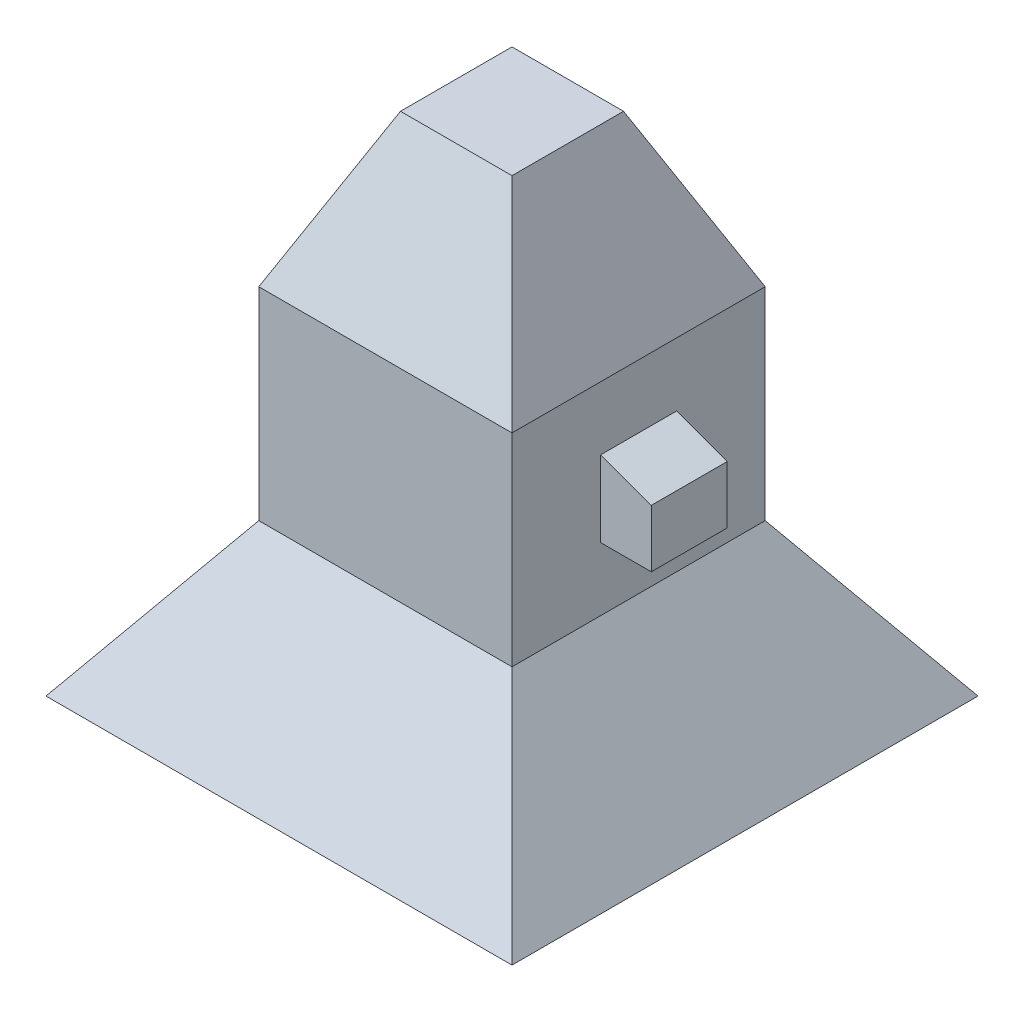
ISO-10303-21;
HEADER;
FILE_DESCRIPTION(('STEP AP214'),'2;1');
FILE_NAME('part.step','',(''),(''),'','','');
FILE_SCHEMA(('AUTOMOTIVE_DESIGN { 1 0 10303 214 1 1 1 1 }'));
ENDSEC;
DATA;
#1=APPLICATION_CONTEXT('core data for automotive mechanical design processes');
#2=APPLICATION_PROTOCOL_DEFINITION('international standard','automotive_design',2000,#1);
#3=PRODUCT_CONTEXT('',#1,'mechanical');
#4=PRODUCT('Part','Part','',(#3));
#5=PRODUCT_RELATED_PRODUCT_CATEGORY('part','',(#4));
#6=PRODUCT_DEFINITION_FORMATION('','',#4);
#7=PRODUCT_DEFINITION_CONTEXT('part definition',#1,'design');
#8=PRODUCT_DEFINITION('design','',#6,#7);
#9=PRODUCT_DEFINITION_SHAPE('','',#8);
#10=(LENGTH_UNIT() NAMED_UNIT(*) SI_UNIT(.MILLI.,.METRE.));
#11=(NAMED_UNIT(*) PLANE_ANGLE_UNIT() SI_UNIT($,.RADIAN.));
#12=(NAMED_UNIT(*) SI_UNIT($,.STERADIAN.) SOLID_ANGLE_UNIT());
#13=UNCERTAINTY_MEASURE_WITH_UNIT(LENGTH_MEASURE(1.E-05),#10,'distance_accuracy_value','');
#14=(GEOMETRIC_REPRESENTATION_CONTEXT(3) GLOBAL_UNCERTAINTY_ASSIGNED_CONTEXT((#13)) GLOBAL_UNIT_ASSIGNED_CONTEXT((#10,
#11,#12)) REPRESENTATION_CONTEXT('',''));
#15=CARTESIAN_POINT('',(0.,0.,0.));
#16=DIRECTION('',(0.,0.,1.));
#17=DIRECTION('',(1.,0.,0.));
#18=AXIS2_PLACEMENT_3D('',#15,#16,#17);
#19=CARTESIAN_POINT('',(50.,80.,50.));
#20=DIRECTION('',(-1.,0.,0.));
#21=DIRECTION('',(0.,0.,1.));
#22=AXIS2_PLACEMENT_3D('',#19,#20,#21);
#23=PLANE('',#22);
#24=DIRECTION('',(0.,0.,-1.));
#25=VECTOR('',#24,1.);
#26=CARTESIAN_POINT('',(50.,0.,50.));
#27=LINE('',#26,#25);
#28=CARTESIAN_POINT('',(50.,0.,50.));
#29=VERTEX_POINT('',#28);
#30=CARTESIAN_POINT('',(50.,0.,-50.));
#31=VERTEX_POINT('',#30);
#32=EDGE_CURVE('E224',#29,#31,#27,.T.);
#33=ORIENTED_EDGE('',*,*,#32,.T.);
#34=DIRECTION('',(0.,-1.,0.));
#35=VECTOR('',#34,1.);
#36=CARTESIAN_POINT('',(50.,80.,-50.));
#37=LINE('',#36,#35);
#38=CARTESIAN_POINT('',(50.,80.,-50.));
#39=VERTEX_POINT('',#38);
#40=EDGE_CURVE('E11',#39,#31,#37,.T.);
#41=ORIENTED_EDGE('',*,*,#40,.F.);
#42=DIRECTION('',(0.,0.,-1.));
#43=VECTOR('',#42,1.);
#44=CARTESIAN_POINT('',(50.,80.,50.));
#45=LINE('',#44,#43);
#46=CARTESIAN_POINT('',(50.,80.,50.));
#47=VERTEX_POINT('',#46);
#48=EDGE_CURVE('E242',#47,#39,#45,.T.);
#49=ORIENTED_EDGE('',*,*,#48,.F.);
#50=DIRECTION('',(0.,-1.,0.));
#51=VECTOR('',#50,1.);
#52=CARTESIAN_POINT('',(50.,80.,50.));
#53=LINE('',#52,#51);
#54=EDGE_CURVE('E255',#47,#29,#53,.T.);
#55=ORIENTED_EDGE('',*,*,#54,.T.);
#56=EDGE_LOOP('',(#33,#41,#49,#55));
#57=FACE_BOUND('',#56,.T.);
#58=DIRECTION('',(0.,1.,0.));
#59=VECTOR('',#58,1.);
#60=CARTESIAN_POINT('',(50.,25.,-15.));
#61=LINE('',#60,#59);
#62=CARTESIAN_POINT('',(50.,25.,-15.));
#63=VERTEX_POINT('',#62);
#64=CARTESIAN_POINT('',(50.,55.,-15.));
#65=VERTEX_POINT('',#64);
#66=EDGE_CURVE('E69',#63,#65,#61,.T.);
#67=ORIENTED_EDGE('',*,*,#66,.F.);
#68=DIRECTION('',(0.,0.,-1.));
#69=VECTOR('',#68,1.);
#70=CARTESIAN_POINT('',(50.,25.,15.));
#71=LINE('',#70,#69);
#72=CARTESIAN_POINT('',(50.,25.,15.));
#73=VERTEX_POINT('',#72);
#74=EDGE_CURVE('E146',#73,#63,#71,.T.);
#75=ORIENTED_EDGE('',*,*,#74,.F.);
#76=DIRECTION('',(0.,-1.,0.));
#77=VECTOR('',#76,1.);
#78=CARTESIAN_POINT('',(50.,25.,15.));
#79=LINE('',#78,#77);
#80=CARTESIAN_POINT('',(50.,55.,15.));
#81=VERTEX_POINT('',#80);
#82=EDGE_CURVE('E148',#81,#73,#79,.T.);
#83=ORIENTED_EDGE('',*,*,#82,.F.);
#84=DIRECTION('',(0.,0.,1.));
#85=VECTOR('',#84,1.);
#86=CARTESIAN_POINT('',(50.,55.,15.));
#87=LINE('',#86,#85);
#88=EDGE_CURVE('E52',#65,#81,#87,.T.);
#89=ORIENTED_EDGE('',*,*,#88,.F.);
#90=EDGE_LOOP('',(#67,#75,#83,#89));
#91=FACE_BOUND('',#90,.T.);
#92=ADVANCED_FACE('F33',(#57,#91),#23,.F.);
#93=CARTESIAN_POINT('',(0.,-60.,0.));
#94=DIRECTION('',(0.,-1.,0.));
#95=DIRECTION('',(0.,0.,-1.));
#96=AXIS2_PLACEMENT_3D('',#93,#94,#95);
#97=PLANE('',#96);
#98=DIRECTION('',(-1.,0.,0.));
#99=VECTOR('',#98,1.);
#100=CARTESIAN_POINT('',(-50.,-60.,-92.0124522925827));
#101=LINE('',#100,#99);
#102=CARTESIAN_POINT('',(-92.0124522925827,-60.,-92.0124522925827));
#103=VERTEX_POINT('',#102);
#104=CARTESIAN_POINT('',(92.0124522925827,-60.,-92.0124522925827));
#105=VERTEX_POINT('',#104);
#106=EDGE_CURVE('E184',#103,#105,#101,.F.);
#107=ORIENTED_EDGE('',*,*,#106,.T.);
#108=DIRECTION('',(0.,0.,-1.));
#109=VECTOR('',#108,1.);
#110=CARTESIAN_POINT('',(92.0124522925827,-60.,-50.));
#111=LINE('',#110,#109);
#112=CARTESIAN_POINT('',(92.0124522925827,-60.,92.0124522925827));
#113=VERTEX_POINT('',#112);
#114=EDGE_CURVE('E216',#105,#113,#111,.F.);
#115=ORIENTED_EDGE('',*,*,#114,.T.);
#116=DIRECTION('',(1.,0.,0.));
#117=VECTOR('',#116,1.);
#118=CARTESIAN_POINT('',(50.,-60.,92.0124522925827));
#119=LINE('',#118,#117);
#120=CARTESIAN_POINT('',(-92.0124522925827,-60.,92.0124522925827));
#121=VERTEX_POINT('',#120);
#122=EDGE_CURVE('E218',#113,#121,#119,.F.);
#123=ORIENTED_EDGE('',*,*,#122,.T.);
#124=DIRECTION('',(0.,0.,1.));
#125=VECTOR('',#124,1.);
#126=CARTESIAN_POINT('',(-92.0124522925827,-60.,50.));
#127=LINE('',#126,#125);
#128=EDGE_CURVE('E209',#121,#103,#127,.F.);
#129=ORIENTED_EDGE('',*,*,#128,.T.);
#130=EDGE_LOOP('',(#107,#115,#123,#129));
#131=FACE_BOUND('',#130,.T.);
#132=DIRECTION('',(-1.,0.,0.));
#133=VECTOR('',#132,1.);
#134=CARTESIAN_POINT('',(0.,-60.,-86.016603056777));
#135=LINE('',#134,#133);
#136=CARTESIAN_POINT('',(-86.016603056777,-60.,-86.016603056777));
#137=VERTEX_POINT('',#136);
#138=CARTESIAN_POINT('',(86.0166030567769,-60.,-86.016603056777));
#139=VERTEX_POINT('',#138);
#140=EDGE_CURVE('E196',#137,#139,#135,.F.);
#141=ORIENTED_EDGE('',*,*,#140,.F.);
#142=DIRECTION('',(0.,0.,1.));
#143=VECTOR('',#142,1.);
#144=CARTESIAN_POINT('',(-86.016603056777,-60.,0.));
#145=LINE('',#144,#143);
#146=CARTESIAN_POINT('',(-86.016603056777,-60.,86.016603056777));
#147=VERTEX_POINT('',#146);
#148=EDGE_CURVE('E180',#147,#137,#145,.F.);
#149=ORIENTED_EDGE('',*,*,#148,.F.);
#150=DIRECTION('',(1.,0.,0.));
#151=VECTOR('',#150,1.);
#152=CARTESIAN_POINT('',(0.,-60.,86.016603056777));
#153=LINE('',#152,#151);
#154=CARTESIAN_POINT('',(86.0166030567769,-60.,86.016603056777));
#155=VERTEX_POINT('',#154);
#156=EDGE_CURVE('E190',#155,#147,#153,.F.);
#157=ORIENTED_EDGE('',*,*,#156,.F.);
#158=DIRECTION('',(0.,0.,-1.));
#159=VECTOR('',#158,1.);
#160=CARTESIAN_POINT('',(86.0166030567769,-60.,0.));
#161=LINE('',#160,#159);
#162=EDGE_CURVE('E198',#139,#155,#161,.F.);
#163=ORIENTED_EDGE('',*,*,#162,.F.);
#164=EDGE_LOOP('',(#141,#149,#157,#163));
#165=FACE_BOUND('',#164,.T.);
#166=ADVANCED_FACE('F293',(#131,#165),#97,.T.);
#167=CARTESIAN_POINT('',(-50.,80.,-50.));
#168=DIRECTION('',(0.,0.,1.));
#169=DIRECTION('',(1.,0.,0.));
#170=AXIS2_PLACEMENT_3D('',#167,#168,#169);
#171=PLANE('',#170);
#172=DIRECTION('',(-1.,0.,0.));
#173=VECTOR('',#172,1.);
#174=CARTESIAN_POINT('',(-50.,0.,-50.));
#175=LINE('',#174,#173);
#176=CARTESIAN_POINT('',(-50.,0.,-50.));
#177=VERTEX_POINT('',#176);
#178=EDGE_CURVE('E258',#31,#177,#175,.T.);
#179=ORIENTED_EDGE('',*,*,#178,.T.);
#180=DIRECTION('',(0.,-1.,0.));
#181=VECTOR('',#180,1.);
#182=CARTESIAN_POINT('',(-50.,80.,-50.));
#183=LINE('',#182,#181);
#184=CARTESIAN_POINT('',(-50.,80.,-50.));
#185=VERTEX_POINT('',#184);
#186=EDGE_CURVE('E43',#185,#177,#183,.T.);
#187=ORIENTED_EDGE('',*,*,#186,.F.);
#188=DIRECTION('',(-1.,0.,0.));
#189=VECTOR('',#188,1.);
#190=CARTESIAN_POINT('',(-50.,80.,-50.));
#191=LINE('',#190,#189);
#192=EDGE_CURVE('E245',#39,#185,#191,.T.);
#193=ORIENTED_EDGE('',*,*,#192,.F.);
#194=ORIENTED_EDGE('',*,*,#40,.T.);
#195=EDGE_LOOP('',(#179,#187,#193,#194));
#196=FACE_BOUND('',#195,.T.);
#197=ADVANCED_FACE('F298',(#196),#171,.F.);
#198=CARTESIAN_POINT('',(-50.,80.,50.));
#199=DIRECTION('',(1.,0.,0.));
#200=DIRECTION('',(0.,0.,-1.));
#201=AXIS2_PLACEMENT_3D('',#198,#199,#200);
#202=PLANE('',#201);
#203=DIRECTION('',(0.,0.,1.));
#204=VECTOR('',#203,1.);
#205=CARTESIAN_POINT('',(-50.,0.,50.));
#206=LINE('',#205,#204);
#207=CARTESIAN_POINT('',(-50.,0.,50.));
#208=VERTEX_POINT('',#207);
#209=EDGE_CURVE('E261',#177,#208,#206,.T.);
#210=ORIENTED_EDGE('',*,*,#209,.T.);
#211=DIRECTION('',(0.,-1.,0.));
#212=VECTOR('',#211,1.);
#213=CARTESIAN_POINT('',(-50.,80.,50.));
#214=LINE('',#213,#212);
#215=CARTESIAN_POINT('',(-50.,80.,50.));
#216=VERTEX_POINT('',#215);
#217=EDGE_CURVE('E268',#216,#208,#214,.T.);
#218=ORIENTED_EDGE('',*,*,#217,.F.);
#219=DIRECTION('',(0.,0.,1.));
#220=VECTOR('',#219,1.);
#221=CARTESIAN_POINT('',(-50.,80.,50.));
#222=LINE('',#221,#220);
#223=EDGE_CURVE('E249',#185,#216,#222,.T.);
#224=ORIENTED_EDGE('',*,*,#223,.F.);
#225=ORIENTED_EDGE('',*,*,#186,.T.);
#226=EDGE_LOOP('',(#210,#218,#224,#225));
#227=FACE_BOUND('',#226,.T.);
#228=ADVANCED_FACE('F304',(#227),#202,.F.);
#229=CARTESIAN_POINT('',(-50.,80.,50.));
#230=DIRECTION('',(0.,0.,-1.));
#231=DIRECTION('',(-1.,0.,0.));
#232=AXIS2_PLACEMENT_3D('',#229,#230,#231);
#233=PLANE('',#232);
#234=DIRECTION('',(1.,0.,0.));
#235=VECTOR('',#234,1.);
#236=CARTESIAN_POINT('',(-50.,0.,50.));
#237=LINE('',#236,#235);
#238=EDGE_CURVE('E246',#208,#29,#237,.T.);
#239=ORIENTED_EDGE('',*,*,#238,.T.);
#240=ORIENTED_EDGE('',*,*,#54,.F.);
#241=DIRECTION('',(1.,0.,0.));
#242=VECTOR('',#241,1.);
#243=CARTESIAN_POINT('',(-50.,80.,50.));
#244=LINE('',#243,#242);
#245=EDGE_CURVE('E252',#216,#47,#244,.T.);
#246=ORIENTED_EDGE('',*,*,#245,.F.);
#247=ORIENTED_EDGE('',*,*,#217,.T.);
#248=EDGE_LOOP('',(#239,#240,#246,#247));
#249=FACE_BOUND('',#248,.T.);
#250=ADVANCED_FACE('F308',(#249),#233,.F.);
#251=CARTESIAN_POINT('',(-50.,80.,50.));
#252=DIRECTION('',(0.,0.4226182617407,0.90630778703665));
#253=DIRECTION('',(0.,-0.90630778703665,0.4226182617407));
#254=AXIS2_PLACEMENT_3D('',#251,#252,#253);
#255=PLANE('',#254);
#256=ORIENTED_EDGE('',*,*,#245,.T.);
#257=DIRECTION('',(0.389281620635026,-0.834817129478987,0.389281620635026));
#258=VECTOR('',#257,1.);
#259=CARTESIAN_POINT('',(50.,80.,50.));
#260=LINE('',#259,#258);
#261=CARTESIAN_POINT('',(22.0215405107,140.,22.0215405107));
#262=VERTEX_POINT('',#261);
#263=EDGE_CURVE('E221',#262,#47,#260,.T.);
#264=ORIENTED_EDGE('',*,*,#263,.F.);
#265=DIRECTION('',(-1.,0.,0.));
#266=VECTOR('',#265,1.);
#267=CARTESIAN_POINT('',(-50.,140.,22.0215405107));
#268=LINE('',#267,#266);
#269=CARTESIAN_POINT('',(-22.0215405107,140.,22.0215405107));
#270=VERTEX_POINT('',#269);
#271=EDGE_CURVE('E204',#270,#262,#268,.F.);
#272=ORIENTED_EDGE('',*,*,#271,.F.);
#273=DIRECTION('',(-0.389281620635026,-0.834817129478987,0.389281620635026));
#274=VECTOR('',#273,1.);
#275=CARTESIAN_POINT('',(-50.,80.,50.));
#276=LINE('',#275,#274);
#277=EDGE_CURVE('E226',#270,#216,#276,.T.);
#278=ORIENTED_EDGE('',*,*,#277,.T.);
#279=EDGE_LOOP('',(#256,#264,#272,#278));
#280=FACE_BOUND('',#279,.T.);
#281=ADVANCED_FACE('F312',(#280),#255,.T.);
#282=CARTESIAN_POINT('',(50.,80.,50.));
#283=DIRECTION('',(0.90630778703665,0.4226182617407,0.));
#284=DIRECTION('',(-0.4226182617407,0.90630778703665,0.));
#285=AXIS2_PLACEMENT_3D('',#282,#283,#284);
#286=PLANE('',#285);
#287=ORIENTED_EDGE('',*,*,#48,.T.);
#288=DIRECTION('',(0.389281620635026,-0.834817129478987,-0.389281620635026));
#289=VECTOR('',#288,1.);
#290=CARTESIAN_POINT('',(50.,80.,-50.));
#291=LINE('',#290,#289);
#292=CARTESIAN_POINT('',(22.0215405107,140.,-22.0215405107));
#293=VERTEX_POINT('',#292);
#294=EDGE_CURVE('E225',#293,#39,#291,.T.);
#295=ORIENTED_EDGE('',*,*,#294,.F.);
#296=DIRECTION('',(0.,0.,1.));
#297=VECTOR('',#296,1.);
#298=CARTESIAN_POINT('',(22.0215405107,140.,50.));
#299=LINE('',#298,#297);
#300=EDGE_CURVE('E237',#262,#293,#299,.F.);
#301=ORIENTED_EDGE('',*,*,#300,.F.);
#302=ORIENTED_EDGE('',*,*,#263,.T.);
#303=EDGE_LOOP('',(#287,#295,#301,#302));
#304=FACE_BOUND('',#303,.T.);
#305=ADVANCED_FACE('F314',(#304),#286,.T.);
#306=CARTESIAN_POINT('',(50.,80.,-50.));
#307=DIRECTION('',(0.,0.4226182617407,-0.90630778703665));
#308=DIRECTION('',(0.,0.90630778703665,0.4226182617407));
#309=AXIS2_PLACEMENT_3D('',#306,#307,#308);
#310=PLANE('',#309);
#311=ORIENTED_EDGE('',*,*,#192,.T.);
#312=DIRECTION('',(-0.389281620635026,-0.834817129478987,-0.389281620635026));
#313=VECTOR('',#312,1.);
#314=CARTESIAN_POINT('',(-50.,80.,-50.));
#315=LINE('',#314,#313);
#316=CARTESIAN_POINT('',(-22.0215405107,140.,-22.0215405107));
#317=VERTEX_POINT('',#316);
#318=EDGE_CURVE('E229',#317,#185,#315,.T.);
#319=ORIENTED_EDGE('',*,*,#318,.F.);
#320=DIRECTION('',(1.,0.,0.));
#321=VECTOR('',#320,1.);
#322=CARTESIAN_POINT('',(50.,140.,-22.0215405107));
#323=LINE('',#322,#321);
#324=EDGE_CURVE('E239',#293,#317,#323,.F.);
#325=ORIENTED_EDGE('',*,*,#324,.F.);
#326=ORIENTED_EDGE('',*,*,#294,.T.);
#327=EDGE_LOOP('',(#311,#319,#325,#326));
#328=FACE_BOUND('',#327,.T.);
#329=ADVANCED_FACE('F317',(#328),#310,.T.);
#330=CARTESIAN_POINT('',(-50.,80.,-50.));
#331=DIRECTION('',(-0.90630778703665,0.4226182617407,0.));
#332=DIRECTION('',(-0.4226182617407,-0.90630778703665,0.));
#333=AXIS2_PLACEMENT_3D('',#330,#331,#332);
#334=PLANE('',#333);
#335=ORIENTED_EDGE('',*,*,#223,.T.);
#336=ORIENTED_EDGE('',*,*,#277,.F.);
#337=DIRECTION('',(0.,0.,-1.));
#338=VECTOR('',#337,1.);
#339=CARTESIAN_POINT('',(-22.0215405107,140.,-50.));
#340=LINE('',#339,#338);
#341=EDGE_CURVE('E230',#317,#270,#340,.F.);
#342=ORIENTED_EDGE('',*,*,#341,.F.);
#343=ORIENTED_EDGE('',*,*,#318,.T.);
#344=EDGE_LOOP('',(#335,#336,#342,#343));
#345=FACE_BOUND('',#344,.T.);
#346=ADVANCED_FACE('F321',(#345),#334,.T.);
#347=CARTESIAN_POINT('',(0.,140.,0.));
#348=DIRECTION('',(0.,1.,0.));
#349=DIRECTION('',(0.,0.,1.));
#350=AXIS2_PLACEMENT_3D('',#347,#348,#349);
#351=PLANE('',#350);
#352=ORIENTED_EDGE('',*,*,#271,.T.);
#353=ORIENTED_EDGE('',*,*,#300,.T.);
#354=ORIENTED_EDGE('',*,*,#324,.T.);
#355=ORIENTED_EDGE('',*,*,#341,.T.);
#356=EDGE_LOOP('',(#352,#353,#354,#355));
#357=FACE_BOUND('',#356,.T.);
#358=ADVANCED_FACE('F325',(#357),#351,.T.);
#359=CARTESIAN_POINT('',(-50.,0.,-50.));
#360=DIRECTION('',(0.,0.573576436351047,-0.819152044288991));
#361=DIRECTION('',(0.,0.819152044288991,0.573576436351047));
#362=AXIS2_PLACEMENT_3D('',#359,#360,#361);
#363=PLANE('',#362);
#364=ORIENTED_EDGE('',*,*,#178,.F.);
#365=DIRECTION('',(-0.497542812164524,0.710564775461629,0.497542812164524));
#366=VECTOR('',#365,1.);
#367=CARTESIAN_POINT('',(50.,0.,-50.));
#368=LINE('',#367,#366);
#369=EDGE_CURVE('E202',#105,#31,#368,.T.);
#370=ORIENTED_EDGE('',*,*,#369,.F.);
#371=ORIENTED_EDGE('',*,*,#106,.F.);
#372=DIRECTION('',(0.497542812164524,0.710564775461629,0.497542812164524));
#373=VECTOR('',#372,1.);
#374=CARTESIAN_POINT('',(-50.,0.,-50.));
#375=LINE('',#374,#373);
#376=EDGE_CURVE('E206',#103,#177,#375,.T.);
#377=ORIENTED_EDGE('',*,*,#376,.T.);
#378=EDGE_LOOP('',(#364,#370,#371,#377));
#379=FACE_BOUND('',#378,.T.);
#380=ADVANCED_FACE('F332',(#379),#363,.T.);
#381=CARTESIAN_POINT('',(50.,0.,-50.));
#382=DIRECTION('',(0.819152044288991,0.573576436351047,0.));
#383=DIRECTION('',(-0.573576436351047,0.819152044288991,0.));
#384=AXIS2_PLACEMENT_3D('',#381,#382,#383);
#385=PLANE('',#384);
#386=ORIENTED_EDGE('',*,*,#32,.F.);
#387=DIRECTION('',(-0.497542812164524,0.710564775461629,-0.497542812164524));
#388=VECTOR('',#387,1.);
#389=CARTESIAN_POINT('',(50.,0.,50.));
#390=LINE('',#389,#388);
#391=EDGE_CURVE('E205',#113,#29,#390,.T.);
#392=ORIENTED_EDGE('',*,*,#391,.F.);
#393=ORIENTED_EDGE('',*,*,#114,.F.);
#394=ORIENTED_EDGE('',*,*,#369,.T.);
#395=EDGE_LOOP('',(#386,#392,#393,#394));
#396=FACE_BOUND('',#395,.T.);
#397=ADVANCED_FACE('F334',(#396),#385,.T.);
#398=CARTESIAN_POINT('',(50.,0.,50.));
#399=DIRECTION('',(0.,0.573576436351047,0.819152044288991));
#400=DIRECTION('',(0.,-0.819152044288991,0.573576436351047));
#401=AXIS2_PLACEMENT_3D('',#398,#399,#400);
#402=PLANE('',#401);
#403=ORIENTED_EDGE('',*,*,#238,.F.);
#404=DIRECTION('',(0.497542812164524,0.710564775461629,-0.497542812164524));
#405=VECTOR('',#404,1.);
#406=CARTESIAN_POINT('',(-50.,0.,50.));
#407=LINE('',#406,#405);
#408=EDGE_CURVE('E208',#121,#208,#407,.T.);
#409=ORIENTED_EDGE('',*,*,#408,.F.);
#410=ORIENTED_EDGE('',*,*,#122,.F.);
#411=ORIENTED_EDGE('',*,*,#391,.T.);
#412=EDGE_LOOP('',(#403,#409,#410,#411));
#413=FACE_BOUND('',#412,.T.);
#414=ADVANCED_FACE('F337',(#413),#402,.T.);
#415=CARTESIAN_POINT('',(-50.,0.,50.));
#416=DIRECTION('',(-0.819152044288991,0.573576436351047,0.));
#417=DIRECTION('',(-0.573576436351047,-0.819152044288991,0.));
#418=AXIS2_PLACEMENT_3D('',#415,#416,#417);
#419=PLANE('',#418);
#420=ORIENTED_EDGE('',*,*,#209,.F.);
#421=ORIENTED_EDGE('',*,*,#376,.F.);
#422=ORIENTED_EDGE('',*,*,#128,.F.);
#423=ORIENTED_EDGE('',*,*,#408,.T.);
#424=EDGE_LOOP('',(#420,#421,#422,#423));
#425=FACE_BOUND('',#424,.T.);
#426=ADVANCED_FACE('F341',(#425),#419,.T.);
#427=CARTESIAN_POINT('',(-72.0124522925827,-40.,72.0124522925827));
#428=DIRECTION('',(-0.819152044288991,0.573576436351047,0.));
#429=DIRECTION('',(-0.573576436351047,-0.819152044288991,0.));
#430=AXIS2_PLACEMENT_3D('',#427,#428,#429);
#431=PLANE('',#430);
#432=DIRECTION('',(0.,0.,-1.));
#433=VECTOR('',#432,1.);
#434=CARTESIAN_POINT('',(-72.0124522925827,-40.,72.0124522925827));
#435=LINE('',#434,#433);
#436=CARTESIAN_POINT('',(-72.0124522925827,-40.,72.0124522925827));
#437=VERTEX_POINT('',#436);
#438=CARTESIAN_POINT('',(-72.0124522925827,-40.,-72.0124522925827));
#439=VERTEX_POINT('',#438);
#440=EDGE_CURVE('E171',#437,#439,#435,.T.);
#441=ORIENTED_EDGE('',*,*,#440,.F.);
#442=DIRECTION('',(0.497542812164524,0.710564775461629,-0.497542812164524));
#443=VECTOR('',#442,1.);
#444=CARTESIAN_POINT('',(-72.0124522925827,-40.,72.0124522925827));
#445=LINE('',#444,#443);
#446=EDGE_CURVE('E186',#147,#437,#445,.T.);
#447=ORIENTED_EDGE('',*,*,#446,.F.);
#448=ORIENTED_EDGE('',*,*,#148,.T.);
#449=DIRECTION('',(0.497542812164524,0.710564775461629,0.497542812164524));
#450=VECTOR('',#449,1.);
#451=CARTESIAN_POINT('',(-36.359252800299,10.9180457888838,-36.359252800299));
#452=LINE('',#451,#450);
#453=EDGE_CURVE('E181',#137,#439,#452,.T.);
#454=ORIENTED_EDGE('',*,*,#453,.T.);
#455=EDGE_LOOP('',(#441,#447,#448,#454));
#456=FACE_BOUND('',#455,.T.);
#457=ADVANCED_FACE('F345',(#456),#431,.F.);
#458=CARTESIAN_POINT('',(72.0124522925827,-40.,-72.0124522925827));
#459=DIRECTION('',(0.,0.573576436351047,-0.819152044288991));
#460=DIRECTION('',(0.,0.819152044288991,0.573576436351047));
#461=AXIS2_PLACEMENT_3D('',#458,#459,#460);
#462=PLANE('',#461);
#463=DIRECTION('',(1.,0.,0.));
#464=VECTOR('',#463,1.);
#465=CARTESIAN_POINT('',(72.0124522925827,-40.,-72.0124522925827));
#466=LINE('',#465,#464);
#467=CARTESIAN_POINT('',(72.0124522925827,-40.,-72.0124522925827));
#468=VERTEX_POINT('',#467);
#469=EDGE_CURVE('E174',#439,#468,#466,.T.);
#470=ORIENTED_EDGE('',*,*,#469,.F.);
#471=ORIENTED_EDGE('',*,*,#453,.F.);
#472=ORIENTED_EDGE('',*,*,#140,.T.);
#473=DIRECTION('',(-0.497542812164524,0.710564775461629,0.497542812164524));
#474=VECTOR('',#473,1.);
#475=CARTESIAN_POINT('',(36.3592528002989,10.9180457888838,-36.359252800299));
#476=LINE('',#475,#474);
#477=EDGE_CURVE('E185',#139,#468,#476,.T.);
#478=ORIENTED_EDGE('',*,*,#477,.T.);
#479=EDGE_LOOP('',(#470,#471,#472,#478));
#480=FACE_BOUND('',#479,.T.);
#481=ADVANCED_FACE('F350',(#480),#462,.F.);
#482=CARTESIAN_POINT('',(72.0124522925827,-40.,72.0124522925827));
#483=DIRECTION('',(0.819152044288991,0.573576436351047,0.));
#484=DIRECTION('',(-0.573576436351047,0.819152044288991,0.));
#485=AXIS2_PLACEMENT_3D('',#482,#483,#484);
#486=PLANE('',#485);
#487=DIRECTION('',(0.,0.,1.));
#488=VECTOR('',#487,1.);
#489=CARTESIAN_POINT('',(72.0124522925827,-40.,72.0124522925827));
#490=LINE('',#489,#488);
#491=CARTESIAN_POINT('',(72.0124522925827,-40.,72.0124522925827));
#492=VERTEX_POINT('',#491);
#493=EDGE_CURVE('E176',#468,#492,#490,.T.);
#494=ORIENTED_EDGE('',*,*,#493,.F.);
#495=ORIENTED_EDGE('',*,*,#477,.F.);
#496=ORIENTED_EDGE('',*,*,#162,.T.);
#497=DIRECTION('',(-0.497542812164524,0.710564775461629,-0.497542812164524));
#498=VECTOR('',#497,1.);
#499=CARTESIAN_POINT('',(72.0124522925827,-40.,72.0124522925827));
#500=LINE('',#499,#498);
#501=EDGE_CURVE('E189',#155,#492,#500,.T.);
#502=ORIENTED_EDGE('',*,*,#501,.T.);
#503=EDGE_LOOP('',(#494,#495,#496,#502));
#504=FACE_BOUND('',#503,.T.);
#505=ADVANCED_FACE('F353',(#504),#486,.F.);
#506=CARTESIAN_POINT('',(72.0124522925827,-40.,72.0124522925827));
#507=DIRECTION('',(0.,0.573576436351047,0.819152044288991));
#508=DIRECTION('',(0.,-0.819152044288991,0.573576436351047));
#509=AXIS2_PLACEMENT_3D('',#506,#507,#508);
#510=PLANE('',#509);
#511=DIRECTION('',(-1.,0.,0.));
#512=VECTOR('',#511,1.);
#513=CARTESIAN_POINT('',(72.0124522925827,-40.,72.0124522925827));
#514=LINE('',#513,#512);
#515=EDGE_CURVE('E178',#492,#437,#514,.T.);
#516=ORIENTED_EDGE('',*,*,#515,.F.);
#517=ORIENTED_EDGE('',*,*,#501,.F.);
#518=ORIENTED_EDGE('',*,*,#156,.T.);
#519=ORIENTED_EDGE('',*,*,#446,.T.);
#520=EDGE_LOOP('',(#516,#517,#518,#519));
#521=FACE_BOUND('',#520,.T.);
#522=ADVANCED_FACE('F357',(#521),#510,.F.);
#523=CARTESIAN_POINT('',(0.,-40.,0.));
#524=DIRECTION('',(0.,1.,0.));
#525=DIRECTION('',(0.,0.,1.));
#526=AXIS2_PLACEMENT_3D('',#523,#524,#525);
#527=PLANE('',#526);
#528=ORIENTED_EDGE('',*,*,#440,.T.);
#529=ORIENTED_EDGE('',*,*,#469,.T.);
#530=ORIENTED_EDGE('',*,*,#493,.T.);
#531=ORIENTED_EDGE('',*,*,#515,.T.);
#532=EDGE_LOOP('',(#528,#529,#530,#531));
#533=FACE_BOUND('',#532,.T.);
#534=ADVANCED_FACE('F361',(#533),#527,.F.);
#535=CARTESIAN_POINT('',(70.,25.,-15.));
#536=DIRECTION('',(0.,0.,1.));
#537=DIRECTION('',(1.,0.,0.));
#538=AXIS2_PLACEMENT_3D('',#535,#536,#537);
#539=PLANE('',#538);
#540=ORIENTED_EDGE('',*,*,#66,.T.);
#541=DIRECTION('',(0.939692620785908,-0.342020143325669,0.));
#542=VECTOR('',#541,1.);
#543=CARTESIAN_POINT('',(50.,55.,-15.));
#544=LINE('',#543,#542);
#545=CARTESIAN_POINT('',(70.,47.7205953146759,-15.));
#546=VERTEX_POINT('',#545);
#547=EDGE_CURVE('E168',#546,#65,#544,.F.);
#548=ORIENTED_EDGE('',*,*,#547,.F.);
#549=DIRECTION('',(0.,1.,0.));
#550=VECTOR('',#549,1.);
#551=CARTESIAN_POINT('',(70.,25.,-15.));
#552=LINE('',#551,#550);
#553=CARTESIAN_POINT('',(70.,25.,-15.));
#554=VERTEX_POINT('',#553);
#555=EDGE_CURVE('E153',#554,#546,#552,.T.);
#556=ORIENTED_EDGE('',*,*,#555,.F.);
#557=DIRECTION('',(-1.,0.,0.));
#558=VECTOR('',#557,1.);
#559=CARTESIAN_POINT('',(70.,25.,-15.));
#560=LINE('',#559,#558);
#561=EDGE_CURVE('E166',#554,#63,#560,.T.);
#562=ORIENTED_EDGE('',*,*,#561,.T.);
#563=EDGE_LOOP('',(#540,#548,#556,#562));
#564=FACE_BOUND('',#563,.T.);
#565=ADVANCED_FACE('F284',(#564),#539,.F.);
#566=CARTESIAN_POINT('',(50.,55.,15.));
#567=DIRECTION('',(0.342020143325669,0.939692620785908,0.));
#568=DIRECTION('',(-0.939692620785908,0.342020143325669,0.));
#569=AXIS2_PLACEMENT_3D('',#566,#567,#568);
#570=PLANE('',#569);
#571=ORIENTED_EDGE('',*,*,#88,.T.);
#572=DIRECTION('',(0.939692620785908,-0.342020143325669,0.));
#573=VECTOR('',#572,1.);
#574=CARTESIAN_POINT('',(77.3022585764879,45.0627905499193,15.));
#575=LINE('',#574,#573);
#576=CARTESIAN_POINT('',(70.,47.7205953146759,15.));
#577=VERTEX_POINT('',#576);
#578=EDGE_CURVE('E37',#577,#81,#575,.F.);
#579=ORIENTED_EDGE('',*,*,#578,.F.);
#580=DIRECTION('',(0.,0.,-1.));
#581=VECTOR('',#580,1.);
#582=CARTESIAN_POINT('',(70.,47.7205953146759,0.));
#583=LINE('',#582,#581);
#584=EDGE_CURVE('E63',#546,#577,#583,.F.);
#585=ORIENTED_EDGE('',*,*,#584,.F.);
#586=ORIENTED_EDGE('',*,*,#547,.T.);
#587=EDGE_LOOP('',(#571,#579,#585,#586));
#588=FACE_BOUND('',#587,.T.);
#589=ADVANCED_FACE('F35',(#588),#570,.T.);
#590=CARTESIAN_POINT('',(70.,25.,15.));
#591=DIRECTION('',(0.,0.,-1.));
#592=DIRECTION('',(-1.,0.,0.));
#593=AXIS2_PLACEMENT_3D('',#590,#591,#592);
#594=PLANE('',#593);
#595=ORIENTED_EDGE('',*,*,#82,.T.);
#596=DIRECTION('',(-1.,0.,0.));
#597=VECTOR('',#596,1.);
#598=CARTESIAN_POINT('',(70.,25.,15.));
#599=LINE('',#598,#597);
#600=CARTESIAN_POINT('',(70.,25.,15.));
#601=VERTEX_POINT('',#600);
#602=EDGE_CURVE('E160',#601,#73,#599,.T.);
#603=ORIENTED_EDGE('',*,*,#602,.F.);
#604=DIRECTION('',(0.,-1.,0.));
#605=VECTOR('',#604,1.);
#606=CARTESIAN_POINT('',(70.,25.,15.));
#607=LINE('',#606,#605);
#608=EDGE_CURVE('E273',#577,#601,#607,.T.);
#609=ORIENTED_EDGE('',*,*,#608,.F.);
#610=ORIENTED_EDGE('',*,*,#578,.T.);
#611=EDGE_LOOP('',(#595,#603,#609,#610));
#612=FACE_BOUND('',#611,.T.);
#613=ADVANCED_FACE('F158',(#612),#594,.F.);
#614=CARTESIAN_POINT('',(70.,25.,15.));
#615=DIRECTION('',(0.,1.,0.));
#616=DIRECTION('',(0.,0.,1.));
#617=AXIS2_PLACEMENT_3D('',#614,#615,#616);
#618=PLANE('',#617);
#619=ORIENTED_EDGE('',*,*,#74,.T.);
#620=ORIENTED_EDGE('',*,*,#561,.F.);
#621=DIRECTION('',(0.,0.,-1.));
#622=VECTOR('',#621,1.);
#623=CARTESIAN_POINT('',(70.,25.,15.));
#624=LINE('',#623,#622);
#625=EDGE_CURVE('E165',#601,#554,#624,.T.);
#626=ORIENTED_EDGE('',*,*,#625,.F.);
#627=ORIENTED_EDGE('',*,*,#602,.T.);
#628=EDGE_LOOP('',(#619,#620,#626,#627));
#629=FACE_BOUND('',#628,.T.);
#630=ADVANCED_FACE('F163',(#629),#618,.F.);
#631=CARTESIAN_POINT('',(70.,0.,0.));
#632=DIRECTION('',(-1.,0.,0.));
#633=DIRECTION('',(0.,0.,1.));
#634=AXIS2_PLACEMENT_3D('',#631,#632,#633);
#635=PLANE('',#634);
#636=ORIENTED_EDGE('',*,*,#555,.T.);
#637=ORIENTED_EDGE('',*,*,#584,.T.);
#638=ORIENTED_EDGE('',*,*,#608,.T.);
#639=ORIENTED_EDGE('',*,*,#625,.T.);
#640=EDGE_LOOP('',(#636,#637,#638,#639));
#641=FACE_BOUND('',#640,.T.);
#642=ADVANCED_FACE('F285',(#641),#635,.F.);
#643=CLOSED_SHELL('',(#92,#166,#197,#228,#250,#281,#305,#329,#346,#358,#380,#397,#414,#426,#457,
#481,#505,#522,#534,#565,#589,#613,#630,#642));
#644=MANIFOLD_SOLID_BREP('B2',#643);
#645=ADVANCED_BREP_SHAPE_REPRESENTATION('',(#18,#644),#14);
#646=SHAPE_DEFINITION_REPRESENTATION(#9,#645);
ENDSEC;
END-ISO-10303-21;
